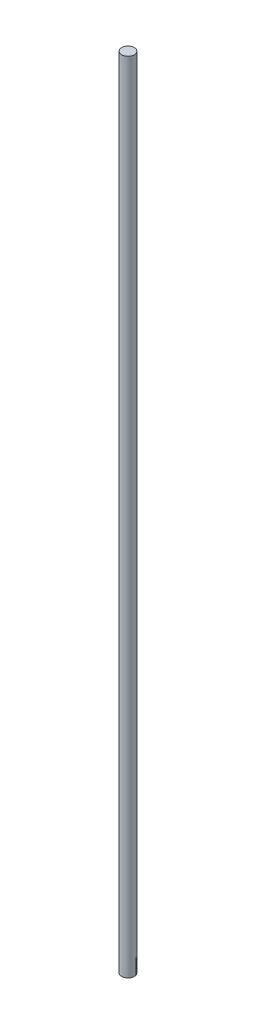
ISO-10303-21;
HEADER;
FILE_DESCRIPTION(('STEP AP214'),'2;1');
FILE_NAME('part.step','',(''),(''),'','','');
FILE_SCHEMA(('AUTOMOTIVE_DESIGN { 1 0 10303 214 1 1 1 1 }'));
ENDSEC;
DATA;
#1=APPLICATION_CONTEXT('core data for automotive mechanical design processes');
#2=APPLICATION_PROTOCOL_DEFINITION('international standard','automotive_design',2000,#1);
#3=PRODUCT_CONTEXT('',#1,'mechanical');
#4=PRODUCT('Part','Part','',(#3));
#5=PRODUCT_RELATED_PRODUCT_CATEGORY('part','',(#4));
#6=PRODUCT_DEFINITION_FORMATION('','',#4);
#7=PRODUCT_DEFINITION_CONTEXT('part definition',#1,'design');
#8=PRODUCT_DEFINITION('design','',#6,#7);
#9=PRODUCT_DEFINITION_SHAPE('','',#8);
#10=(LENGTH_UNIT() NAMED_UNIT(*) SI_UNIT(.MILLI.,.METRE.));
#11=(NAMED_UNIT(*) PLANE_ANGLE_UNIT() SI_UNIT($,.RADIAN.));
#12=(NAMED_UNIT(*) SI_UNIT($,.STERADIAN.) SOLID_ANGLE_UNIT());
#13=UNCERTAINTY_MEASURE_WITH_UNIT(LENGTH_MEASURE(1.E-05),#10,'distance_accuracy_value','');
#14=(GEOMETRIC_REPRESENTATION_CONTEXT(3) GLOBAL_UNCERTAINTY_ASSIGNED_CONTEXT((#13)) GLOBAL_UNIT_ASSIGNED_CONTEXT((#10,
#11,#12)) REPRESENTATION_CONTEXT('',''));
#15=CARTESIAN_POINT('',(0.,0.,0.));
#16=DIRECTION('',(0.,0.,1.));
#17=DIRECTION('',(1.,0.,0.));
#18=AXIS2_PLACEMENT_3D('',#15,#16,#17);
#19=CARTESIAN_POINT('',(14.,618.,0.));
#20=DIRECTION('',(0.,-1.,0.));
#21=DIRECTION('',(0.,0.,-1.));
#22=AXIS2_PLACEMENT_3D('',#19,#20,#21);
#23=CYLINDRICAL_SURFACE('',#22,3.);
#24=CARTESIAN_POINT('',(14.,618.,0.));
#25=DIRECTION('',(0.,1.,0.));
#26=DIRECTION('',(0.,0.,1.));
#27=AXIS2_PLACEMENT_3D('',#24,#25,#26);
#28=CIRCLE('',#27,3.);
#29=CARTESIAN_POINT('',(14.,618.,3.));
#30=VERTEX_POINT('',#29);
#31=EDGE_CURVE('E10',#30,#30,#28,.T.);
#32=ORIENTED_EDGE('',*,*,#31,.F.);
#33=EDGE_LOOP('',(#32));
#34=FACE_BOUND('',#33,.T.);
#35=CARTESIAN_POINT('',(14.,237.,0.));
#36=DIRECTION('',(0.,1.,0.));
#37=DIRECTION('',(0.,0.,1.));
#38=AXIS2_PLACEMENT_3D('',#35,#36,#37);
#39=CIRCLE('',#38,3.);
#40=CARTESIAN_POINT('',(14.,237.,3.));
#41=VERTEX_POINT('',#40);
#42=EDGE_CURVE('E40',#41,#41,#39,.T.);
#43=ORIENTED_EDGE('',*,*,#42,.T.);
#44=EDGE_LOOP('',(#43));
#45=FACE_BOUND('',#44,.T.);
#46=ADVANCED_FACE('F37',(#34,#45),#23,.T.);
#47=CARTESIAN_POINT('',(14.,618.,0.));
#48=DIRECTION('',(0.,1.,0.));
#49=DIRECTION('',(0.,0.,1.));
#50=AXIS2_PLACEMENT_3D('',#47,#48,#49);
#51=PLANE('',#50);
#52=ORIENTED_EDGE('',*,*,#31,.T.);
#53=EDGE_LOOP('',(#52));
#54=FACE_BOUND('',#53,.T.);
#55=ADVANCED_FACE('F67',(#54),#51,.T.);
#56=CARTESIAN_POINT('',(14.,237.,0.));
#57=DIRECTION('',(0.,1.,0.));
#58=DIRECTION('',(0.,0.,1.));
#59=AXIS2_PLACEMENT_3D('',#56,#57,#58);
#60=PLANE('',#59);
#61=CARTESIAN_POINT('',(14.,237.,0.));
#62=DIRECTION('',(0.,1.,0.));
#63=DIRECTION('',(0.,0.,1.));
#64=AXIS2_PLACEMENT_3D('',#61,#62,#63);
#65=CIRCLE('',#64,1.25);
#66=CARTESIAN_POINT('',(14.,237.,1.25));
#67=VERTEX_POINT('',#66);
#68=EDGE_CURVE('E49',#67,#67,#65,.T.);
#69=ORIENTED_EDGE('',*,*,#68,.T.);
#70=EDGE_LOOP('',(#69));
#71=FACE_BOUND('',#70,.T.);
#72=ORIENTED_EDGE('',*,*,#42,.F.);
#73=EDGE_LOOP('',(#72));
#74=FACE_BOUND('',#73,.T.);
#75=ADVANCED_FACE('F64',(#71,#74),#60,.F.);
#76=CARTESIAN_POINT('',(14.,257.,0.));
#77=DIRECTION('',(0.,-1.,0.));
#78=DIRECTION('',(0.,0.,-1.));
#79=AXIS2_PLACEMENT_3D('',#76,#77,#78);
#80=CYLINDRICAL_SURFACE('',#79,1.25);
#81=CARTESIAN_POINT('',(14.,257.,0.));
#82=DIRECTION('',(0.,1.,0.));
#83=DIRECTION('',(0.,0.,1.));
#84=AXIS2_PLACEMENT_3D('',#81,#82,#83);
#85=CIRCLE('',#84,1.25);
#86=CARTESIAN_POINT('',(14.,257.,1.25));
#87=VERTEX_POINT('',#86);
#88=EDGE_CURVE('E47',#87,#87,#85,.T.);
#89=ORIENTED_EDGE('',*,*,#88,.T.);
#90=EDGE_LOOP('',(#89));
#91=FACE_BOUND('',#90,.T.);
#92=ORIENTED_EDGE('',*,*,#68,.F.);
#93=EDGE_LOOP('',(#92));
#94=FACE_BOUND('',#93,.T.);
#95=ADVANCED_FACE('F55',(#91,#94),#80,.F.);
#96=CARTESIAN_POINT('',(14.,257.,0.));
#97=DIRECTION('',(0.,1.,0.));
#98=DIRECTION('',(0.,0.,1.));
#99=AXIS2_PLACEMENT_3D('',#96,#97,#98);
#100=PLANE('',#99);
#101=ORIENTED_EDGE('',*,*,#88,.F.);
#102=EDGE_LOOP('',(#101));
#103=FACE_BOUND('',#102,.T.);
#104=ADVANCED_FACE('F58',(#103),#100,.F.);
#105=CLOSED_SHELL('',(#46,#55,#75,#95,#104));
#106=MANIFOLD_SOLID_BREP('B2',#105);
#107=ADVANCED_BREP_SHAPE_REPRESENTATION('',(#18,#106),#14);
#108=SHAPE_DEFINITION_REPRESENTATION(#9,#107);
ENDSEC;
END-ISO-10303-21;
